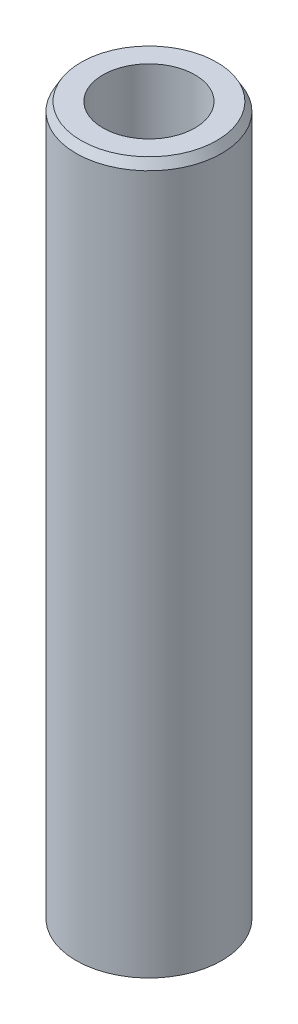
ISO-10303-21;
HEADER;
FILE_DESCRIPTION(('STEP AP214'),'2;1');
FILE_NAME('part.step','',(''),(''),'','','');
FILE_SCHEMA(('AUTOMOTIVE_DESIGN { 1 0 10303 214 1 1 1 1 }'));
ENDSEC;
DATA;
#1=APPLICATION_CONTEXT('core data for automotive mechanical design processes');
#2=APPLICATION_PROTOCOL_DEFINITION('international standard','automotive_design',2000,#1);
#3=PRODUCT_CONTEXT('',#1,'mechanical');
#4=PRODUCT('Part','Part','',(#3));
#5=PRODUCT_RELATED_PRODUCT_CATEGORY('part','',(#4));
#6=PRODUCT_DEFINITION_FORMATION('','',#4);
#7=PRODUCT_DEFINITION_CONTEXT('part definition',#1,'design');
#8=PRODUCT_DEFINITION('design','',#6,#7);
#9=PRODUCT_DEFINITION_SHAPE('','',#8);
#10=(LENGTH_UNIT() NAMED_UNIT(*) SI_UNIT(.MILLI.,.METRE.));
#11=(NAMED_UNIT(*) PLANE_ANGLE_UNIT() SI_UNIT($,.RADIAN.));
#12=(NAMED_UNIT(*) SI_UNIT($,.STERADIAN.) SOLID_ANGLE_UNIT());
#13=UNCERTAINTY_MEASURE_WITH_UNIT(LENGTH_MEASURE(1.E-05),#10,'distance_accuracy_value','');
#14=(GEOMETRIC_REPRESENTATION_CONTEXT(3) GLOBAL_UNCERTAINTY_ASSIGNED_CONTEXT((#13)) GLOBAL_UNIT_ASSIGNED_CONTEXT((#10,
#11,#12)) REPRESENTATION_CONTEXT('',''));
#15=CARTESIAN_POINT('',(0.,0.,0.));
#16=DIRECTION('',(0.,0.,1.));
#17=DIRECTION('',(1.,0.,0.));
#18=AXIS2_PLACEMENT_3D('',#15,#16,#17);
#19=CARTESIAN_POINT('',(0.,73.3791310693852,0.));
#20=DIRECTION('',(0.,-1.,0.));
#21=DIRECTION('',(0.,0.,-1.));
#22=AXIS2_PLACEMENT_3D('',#19,#20,#21);
#23=CYLINDRICAL_SURFACE('',#22,7.5);
#24=CARTESIAN_POINT('',(0.,72.4909554867551,0.));
#25=DIRECTION('',(0.,1.,0.));
#26=DIRECTION('',(0.,0.,1.));
#27=AXIS2_PLACEMENT_3D('',#24,#25,#26);
#28=CIRCLE('',#27,7.5);
#29=CARTESIAN_POINT('',(0.,72.4909554867551,7.5));
#30=VERTEX_POINT('',#29);
#31=EDGE_CURVE('E50',#30,#30,#28,.F.);
#32=ORIENTED_EDGE('',*,*,#31,.T.);
#33=EDGE_LOOP('',(#32));
#34=FACE_BOUND('',#33,.T.);
#35=CARTESIAN_POINT('',(0.,0.512788411719173,0.));
#36=DIRECTION('',(0.,1.,0.));
#37=DIRECTION('',(0.,0.,1.));
#38=AXIS2_PLACEMENT_3D('',#35,#36,#37);
#39=CIRCLE('',#38,7.5);
#40=CARTESIAN_POINT('',(0.,0.512788411719173,7.5));
#41=VERTEX_POINT('',#40);
#42=EDGE_CURVE('E51',#41,#41,#39,.T.);
#43=ORIENTED_EDGE('',*,*,#42,.T.);
#44=EDGE_LOOP('',(#43));
#45=FACE_BOUND('',#44,.T.);
#46=ADVANCED_FACE('F39',(#34,#45),#23,.T.);
#47=CARTESIAN_POINT('',(0.,73.3791310693852,0.));
#48=DIRECTION('',(0.,1.,0.));
#49=DIRECTION('',(0.,0.,1.));
#50=AXIS2_PLACEMENT_3D('',#47,#48,#49);
#51=PLANE('',#50);
#52=CARTESIAN_POINT('',(0.,73.3791310693852,0.));
#53=DIRECTION('',(0.,1.,0.));
#54=DIRECTION('',(0.,0.,1.));
#55=AXIS2_PLACEMENT_3D('',#52,#53,#54);
#56=CIRCLE('',#55,6.98721158828083);
#57=CARTESIAN_POINT('',(0.,73.3791310693852,6.98721158828083));
#58=VERTEX_POINT('',#57);
#59=EDGE_CURVE('E54',#58,#58,#56,.T.);
#60=ORIENTED_EDGE('',*,*,#59,.T.);
#61=EDGE_LOOP('',(#60));
#62=FACE_BOUND('',#61,.T.);
#63=CARTESIAN_POINT('',(0.,73.3791310693852,0.));
#64=DIRECTION('',(0.,1.,0.));
#65=DIRECTION('',(0.,0.,1.));
#66=AXIS2_PLACEMENT_3D('',#63,#64,#65);
#67=CIRCLE('',#66,4.74031689962865);
#68=CARTESIAN_POINT('',(0.,73.3791310693852,4.74031689962865));
#69=VERTEX_POINT('',#68);
#70=EDGE_CURVE('E58',#69,#69,#67,.T.);
#71=ORIENTED_EDGE('',*,*,#70,.F.);
#72=EDGE_LOOP('',(#71));
#73=FACE_BOUND('',#72,.T.);
#74=ADVANCED_FACE('F69',(#62,#73),#51,.T.);
#75=CARTESIAN_POINT('',(0.,0.,0.));
#76=DIRECTION('',(0.,1.,0.));
#77=DIRECTION('',(0.,0.,1.));
#78=AXIS2_PLACEMENT_3D('',#75,#76,#77);
#79=PLANE('',#78);
#80=CARTESIAN_POINT('',(0.,0.,0.));
#81=DIRECTION('',(0.,1.,0.));
#82=DIRECTION('',(0.,0.,1.));
#83=AXIS2_PLACEMENT_3D('',#80,#81,#82);
#84=CIRCLE('',#83,6.61182441736984);
#85=CARTESIAN_POINT('',(0.,0.,6.61182441736984));
#86=VERTEX_POINT('',#85);
#87=EDGE_CURVE('E10',#86,#86,#84,.F.);
#88=ORIENTED_EDGE('',*,*,#87,.T.);
#89=EDGE_LOOP('',(#88));
#90=FACE_BOUND('',#89,.T.);
#91=CARTESIAN_POINT('',(0.,0.,0.));
#92=DIRECTION('',(0.,1.,0.));
#93=DIRECTION('',(0.,0.,1.));
#94=AXIS2_PLACEMENT_3D('',#91,#92,#93);
#95=CIRCLE('',#94,4.74031689962865);
#96=CARTESIAN_POINT('',(0.,0.,4.74031689962865));
#97=VERTEX_POINT('',#96);
#98=EDGE_CURVE('E63',#97,#97,#95,.T.);
#99=ORIENTED_EDGE('',*,*,#98,.T.);
#100=EDGE_LOOP('',(#99));
#101=FACE_BOUND('',#100,.T.);
#102=ADVANCED_FACE('F75',(#90,#101),#79,.F.);
#103=CARTESIAN_POINT('',(0.,73.3791310693852,0.));
#104=DIRECTION('',(0.,-1.,0.));
#105=DIRECTION('',(0.,0.,-1.));
#106=AXIS2_PLACEMENT_3D('',#103,#104,#105);
#107=CYLINDRICAL_SURFACE('',#106,4.74031689962865);
#108=ORIENTED_EDGE('',*,*,#70,.T.);
#109=EDGE_LOOP('',(#108));
#110=FACE_BOUND('',#109,.T.);
#111=ORIENTED_EDGE('',*,*,#98,.F.);
#112=EDGE_LOOP('',(#111));
#113=FACE_BOUND('',#112,.T.);
#114=ADVANCED_FACE('F70',(#110,#113),#107,.F.);
#115=CARTESIAN_POINT('',(0.,73.3791310693852,0.));
#116=DIRECTION('',(0.,-1.,0.));
#117=DIRECTION('',(0.,0.,-1.));
#118=AXIS2_PLACEMENT_3D('',#115,#116,#117);
#119=CONICAL_SURFACE('',#118,6.98721158828083,0.523598775598291);
#120=ORIENTED_EDGE('',*,*,#31,.F.);
#121=EDGE_LOOP('',(#120));
#122=FACE_BOUND('',#121,.T.);
#123=ORIENTED_EDGE('',*,*,#59,.F.);
#124=EDGE_LOOP('',(#123));
#125=FACE_BOUND('',#124,.T.);
#126=ADVANCED_FACE('F81',(#122,#125),#119,.T.);
#127=CARTESIAN_POINT('',(0.,0.512788411719173,0.));
#128=DIRECTION('',(0.,1.,0.));
#129=DIRECTION('',(0.,0.,1.));
#130=AXIS2_PLACEMENT_3D('',#127,#128,#129);
#131=CONICAL_SURFACE('',#130,7.5,1.0471975511966);
#132=ORIENTED_EDGE('',*,*,#87,.F.);
#133=EDGE_LOOP('',(#132));
#134=FACE_BOUND('',#133,.T.);
#135=ORIENTED_EDGE('',*,*,#42,.F.);
#136=EDGE_LOOP('',(#135));
#137=FACE_BOUND('',#136,.T.);
#138=ADVANCED_FACE('F45',(#134,#137),#131,.T.);
#139=CLOSED_SHELL('',(#46,#74,#102,#114,#126,#138));
#140=MANIFOLD_SOLID_BREP('B2',#139);
#141=ADVANCED_BREP_SHAPE_REPRESENTATION('',(#18,#140),#14);
#142=SHAPE_DEFINITION_REPRESENTATION(#9,#141);
ENDSEC;
END-ISO-10303-21;
